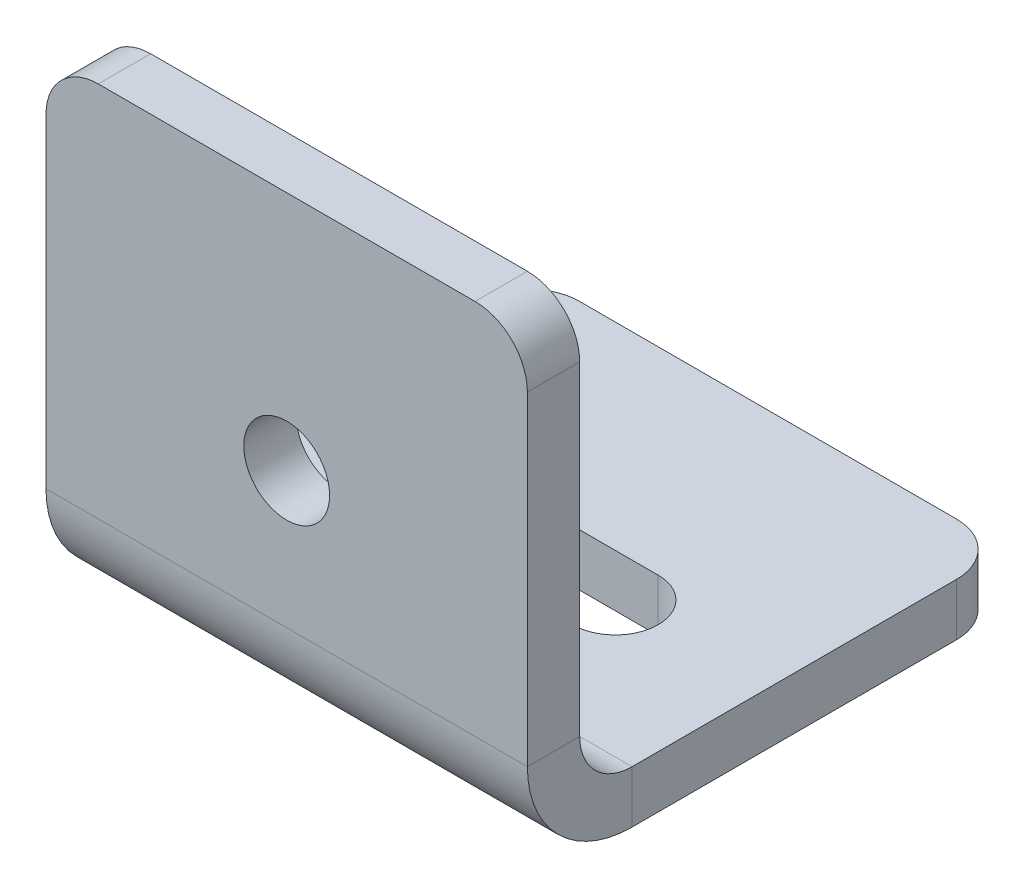
ISO-10303-21;
HEADER;
FILE_DESCRIPTION(('STEP AP214'),'2;1');
FILE_NAME('part.step','',(''),(''),'','','');
FILE_SCHEMA(('AUTOMOTIVE_DESIGN { 1 0 10303 214 1 1 1 1 }'));
ENDSEC;
DATA;
#1=APPLICATION_CONTEXT('core data for automotive mechanical design processes');
#2=APPLICATION_PROTOCOL_DEFINITION('international standard','automotive_design',2000,#1);
#3=PRODUCT_CONTEXT('',#1,'mechanical');
#4=PRODUCT('Part','Part','',(#3));
#5=PRODUCT_RELATED_PRODUCT_CATEGORY('part','',(#4));
#6=PRODUCT_DEFINITION_FORMATION('','',#4);
#7=PRODUCT_DEFINITION_CONTEXT('part definition',#1,'design');
#8=PRODUCT_DEFINITION('design','',#6,#7);
#9=PRODUCT_DEFINITION_SHAPE('','',#8);
#10=(LENGTH_UNIT() NAMED_UNIT(*) SI_UNIT(.MILLI.,.METRE.));
#11=(NAMED_UNIT(*) PLANE_ANGLE_UNIT() SI_UNIT($,.RADIAN.));
#12=(NAMED_UNIT(*) SI_UNIT($,.STERADIAN.) SOLID_ANGLE_UNIT());
#13=UNCERTAINTY_MEASURE_WITH_UNIT(LENGTH_MEASURE(1.E-05),#10,'distance_accuracy_value','');
#14=(GEOMETRIC_REPRESENTATION_CONTEXT(3) GLOBAL_UNCERTAINTY_ASSIGNED_CONTEXT((#13)) GLOBAL_UNIT_ASSIGNED_CONTEXT((#10,
#11,#12)) REPRESENTATION_CONTEXT('',''));
#15=CARTESIAN_POINT('',(0.,0.,0.));
#16=DIRECTION('',(0.,0.,1.));
#17=DIRECTION('',(1.,0.,0.));
#18=AXIS2_PLACEMENT_3D('',#15,#16,#17);
#19=CARTESIAN_POINT('',(46.,10.,0.));
#20=DIRECTION('',(1.,0.,0.));
#21=DIRECTION('',(0.,0.,-1.));
#22=AXIS2_PLACEMENT_3D('',#19,#20,#21);
#23=PLANE('',#22);
#24=DIRECTION('',(0.,0.,-1.));
#25=VECTOR('',#24,1.);
#26=CARTESIAN_POINT('',(46.,10.,0.));
#27=LINE('',#26,#25);
#28=CARTESIAN_POINT('',(46.,10.,0.));
#29=VERTEX_POINT('',#28);
#30=CARTESIAN_POINT('',(46.,10.,-5.));
#31=VERTEX_POINT('',#30);
#32=EDGE_CURVE('E243',#29,#31,#27,.T.);
#33=ORIENTED_EDGE('',*,*,#32,.F.);
#34=CARTESIAN_POINT('',(46.,10.,-10.));
#35=DIRECTION('',(-1.,0.,0.));
#36=DIRECTION('',(0.,0.,1.));
#37=AXIS2_PLACEMENT_3D('',#34,#35,#36);
#38=CIRCLE('',#37,10.);
#39=CARTESIAN_POINT('',(46.,0.,-10.));
#40=VERTEX_POINT('',#39);
#41=EDGE_CURVE('E197',#29,#40,#38,.F.);
#42=ORIENTED_EDGE('',*,*,#41,.T.);
#43=DIRECTION('',(0.,-1.,0.));
#44=VECTOR('',#43,1.);
#45=CARTESIAN_POINT('',(46.,5.,-10.));
#46=LINE('',#45,#44);
#47=CARTESIAN_POINT('',(46.,5.,-10.));
#48=VERTEX_POINT('',#47);
#49=EDGE_CURVE('E241',#48,#40,#46,.T.);
#50=ORIENTED_EDGE('',*,*,#49,.F.);
#51=CARTESIAN_POINT('',(46.,10.,-10.));
#52=DIRECTION('',(1.,0.,0.));
#53=DIRECTION('',(0.,0.,-1.));
#54=AXIS2_PLACEMENT_3D('',#51,#52,#53);
#55=CIRCLE('',#54,5.);
#56=EDGE_CURVE('E190',#31,#48,#55,.T.);
#57=ORIENTED_EDGE('',*,*,#56,.F.);
#58=EDGE_LOOP('',(#33,#42,#50,#57));
#59=FACE_BOUND('',#58,.T.);
#60=ADVANCED_FACE('F16',(#59),#23,.T.);
#61=CARTESIAN_POINT('',(46.,5.,-10.));
#62=DIRECTION('',(1.,0.,0.));
#63=DIRECTION('',(0.,0.,-1.));
#64=AXIS2_PLACEMENT_3D('',#61,#62,#63);
#65=PLANE('',#64);
#66=DIRECTION('',(0.,1.,0.));
#67=VECTOR('',#66,1.);
#68=CARTESIAN_POINT('',(46.,0.,-5.));
#69=LINE('',#68,#67);
#70=CARTESIAN_POINT('',(46.,41.,-5.));
#71=VERTEX_POINT('',#70);
#72=EDGE_CURVE('E193',#71,#31,#69,.F.);
#73=ORIENTED_EDGE('',*,*,#72,.F.);
#74=DIRECTION('',(0.,0.,-1.));
#75=VECTOR('',#74,1.);
#76=CARTESIAN_POINT('',(46.,41.,-10.));
#77=LINE('',#76,#75);
#78=CARTESIAN_POINT('',(46.,41.,0.));
#79=VERTEX_POINT('',#78);
#80=EDGE_CURVE('E256',#71,#79,#77,.F.);
#81=ORIENTED_EDGE('',*,*,#80,.T.);
#82=DIRECTION('',(0.,-1.,0.));
#83=VECTOR('',#82,1.);
#84=CARTESIAN_POINT('',(46.,0.,0.));
#85=LINE('',#84,#83);
#86=EDGE_CURVE('E195',#79,#29,#85,.T.);
#87=ORIENTED_EDGE('',*,*,#86,.T.);
#88=ORIENTED_EDGE('',*,*,#32,.T.);
#89=EDGE_LOOP('',(#73,#81,#87,#88));
#90=FACE_BOUND('',#89,.T.);
#91=ADVANCED_FACE('F321',(#90),#65,.T.);
#92=CARTESIAN_POINT('',(0.,0.,-10.));
#93=DIRECTION('',(-1.,0.,0.));
#94=DIRECTION('',(0.,0.,1.));
#95=AXIS2_PLACEMENT_3D('',#92,#93,#94);
#96=PLANE('',#95);
#97=DIRECTION('',(0.,1.,0.));
#98=VECTOR('',#97,1.);
#99=CARTESIAN_POINT('',(0.,0.,-10.));
#100=LINE('',#99,#98);
#101=CARTESIAN_POINT('',(0.,0.,-10.));
#102=VERTEX_POINT('',#101);
#103=CARTESIAN_POINT('',(0.,5.,-10.));
#104=VERTEX_POINT('',#103);
#105=EDGE_CURVE('E239',#102,#104,#100,.T.);
#106=ORIENTED_EDGE('',*,*,#105,.F.);
#107=CARTESIAN_POINT('',(0.,10.,-10.));
#108=DIRECTION('',(-1.,0.,0.));
#109=DIRECTION('',(0.,0.,1.));
#110=AXIS2_PLACEMENT_3D('',#107,#108,#109);
#111=CIRCLE('',#110,10.);
#112=CARTESIAN_POINT('',(0.,10.,0.));
#113=VERTEX_POINT('',#112);
#114=EDGE_CURVE('E188',#113,#102,#111,.F.);
#115=ORIENTED_EDGE('',*,*,#114,.F.);
#116=DIRECTION('',(0.,0.,1.));
#117=VECTOR('',#116,1.);
#118=CARTESIAN_POINT('',(0.,10.,-5.));
#119=LINE('',#118,#117);
#120=CARTESIAN_POINT('',(0.,10.,-5.));
#121=VERTEX_POINT('',#120);
#122=EDGE_CURVE('E236',#121,#113,#119,.T.);
#123=ORIENTED_EDGE('',*,*,#122,.F.);
#124=CARTESIAN_POINT('',(0.,10.,-10.));
#125=DIRECTION('',(1.,0.,0.));
#126=DIRECTION('',(0.,0.,-1.));
#127=AXIS2_PLACEMENT_3D('',#124,#125,#126);
#128=CIRCLE('',#127,5.);
#129=EDGE_CURVE('E206',#121,#104,#128,.T.);
#130=ORIENTED_EDGE('',*,*,#129,.T.);
#131=EDGE_LOOP('',(#106,#115,#123,#130));
#132=FACE_BOUND('',#131,.T.);
#133=ADVANCED_FACE('F309',(#132),#96,.T.);
#134=CARTESIAN_POINT('',(0.,10.,-5.));
#135=DIRECTION('',(-1.,0.,0.));
#136=DIRECTION('',(0.,0.,1.));
#137=AXIS2_PLACEMENT_3D('',#134,#135,#136);
#138=PLANE('',#137);
#139=DIRECTION('',(0.,0.,-1.));
#140=VECTOR('',#139,1.);
#141=CARTESIAN_POINT('',(0.,5.,0.));
#142=LINE('',#141,#140);
#143=CARTESIAN_POINT('',(0.,5.,-41.));
#144=VERTEX_POINT('',#143);
#145=EDGE_CURVE('E203',#104,#144,#142,.T.);
#146=ORIENTED_EDGE('',*,*,#145,.T.);
#147=DIRECTION('',(0.,-1.,0.));
#148=VECTOR('',#147,1.);
#149=CARTESIAN_POINT('',(0.,10.,-41.));
#150=LINE('',#149,#148);
#151=CARTESIAN_POINT('',(0.,0.,-41.));
#152=VERTEX_POINT('',#151);
#153=EDGE_CURVE('E265',#144,#152,#150,.T.);
#154=ORIENTED_EDGE('',*,*,#153,.T.);
#155=DIRECTION('',(0.,0.,-1.));
#156=VECTOR('',#155,1.);
#157=CARTESIAN_POINT('',(0.,0.,0.));
#158=LINE('',#157,#156);
#159=EDGE_CURVE('E181',#102,#152,#158,.T.);
#160=ORIENTED_EDGE('',*,*,#159,.F.);
#161=ORIENTED_EDGE('',*,*,#105,.T.);
#162=EDGE_LOOP('',(#146,#154,#160,#161));
#163=FACE_BOUND('',#162,.T.);
#164=ADVANCED_FACE('F288',(#163),#138,.T.);
#165=CARTESIAN_POINT('',(46.,0.,0.));
#166=DIRECTION('',(0.,1.,0.));
#167=DIRECTION('',(0.,0.,1.));
#168=AXIS2_PLACEMENT_3D('',#165,#166,#167);
#169=PLANE('',#168);
#170=DIRECTION('',(-1.,0.,0.));
#171=VECTOR('',#170,1.);
#172=CARTESIAN_POINT('',(14.6,0.,-27.1));
#173=LINE('',#172,#171);
#174=CARTESIAN_POINT('',(31.4,0.,-27.1));
#175=VERTEX_POINT('',#174);
#176=CARTESIAN_POINT('',(14.6,0.,-27.1));
#177=VERTEX_POINT('',#176);
#178=EDGE_CURVE('E143',#175,#177,#173,.T.);
#179=ORIENTED_EDGE('',*,*,#178,.T.);
#180=CARTESIAN_POINT('',(14.6,0.,-23.));
#181=DIRECTION('',(0.,1.,0.));
#182=DIRECTION('',(0.,0.,1.));
#183=AXIS2_PLACEMENT_3D('',#180,#181,#182);
#184=CIRCLE('',#183,4.10000000000001);
#185=CARTESIAN_POINT('',(14.6,0.,-18.9));
#186=VERTEX_POINT('',#185);
#187=EDGE_CURVE('E135',#177,#186,#184,.T.);
#188=ORIENTED_EDGE('',*,*,#187,.T.);
#189=DIRECTION('',(1.,0.,0.));
#190=VECTOR('',#189,1.);
#191=CARTESIAN_POINT('',(14.6,0.,-18.9));
#192=LINE('',#191,#190);
#193=CARTESIAN_POINT('',(31.4,0.,-18.9));
#194=VERTEX_POINT('',#193);
#195=EDGE_CURVE('E147',#186,#194,#192,.T.);
#196=ORIENTED_EDGE('',*,*,#195,.T.);
#197=CARTESIAN_POINT('',(31.4,0.,-23.));
#198=DIRECTION('',(0.,1.,0.));
#199=DIRECTION('',(0.,0.,1.));
#200=AXIS2_PLACEMENT_3D('',#197,#198,#199);
#201=CIRCLE('',#200,4.10000000000001);
#202=EDGE_CURVE('E151',#194,#175,#201,.T.);
#203=ORIENTED_EDGE('',*,*,#202,.T.);
#204=EDGE_LOOP('',(#179,#188,#196,#203));
#205=FACE_BOUND('',#204,.T.);
#206=ORIENTED_EDGE('',*,*,#159,.T.);
#207=CARTESIAN_POINT('',(5.,0.,-41.));
#208=DIRECTION('',(0.,1.,0.));
#209=DIRECTION('',(0.,0.,1.));
#210=AXIS2_PLACEMENT_3D('',#207,#208,#209);
#211=CIRCLE('',#210,5.);
#212=CARTESIAN_POINT('',(5.,0.,-46.));
#213=VERTEX_POINT('',#212);
#214=EDGE_CURVE('E270',#152,#213,#211,.F.);
#215=ORIENTED_EDGE('',*,*,#214,.T.);
#216=DIRECTION('',(-1.,0.,0.));
#217=VECTOR('',#216,1.);
#218=CARTESIAN_POINT('',(46.,0.,-46.));
#219=LINE('',#218,#217);
#220=CARTESIAN_POINT('',(41.,0.,-46.));
#221=VERTEX_POINT('',#220);
#222=EDGE_CURVE('E234',#221,#213,#219,.T.);
#223=ORIENTED_EDGE('',*,*,#222,.F.);
#224=CARTESIAN_POINT('',(41.,0.,-41.));
#225=DIRECTION('',(0.,1.,0.));
#226=DIRECTION('',(0.,0.,1.));
#227=AXIS2_PLACEMENT_3D('',#224,#225,#226);
#228=CIRCLE('',#227,5.);
#229=CARTESIAN_POINT('',(46.,0.,-41.));
#230=VERTEX_POINT('',#229);
#231=EDGE_CURVE('E268',#221,#230,#228,.F.);
#232=ORIENTED_EDGE('',*,*,#231,.T.);
#233=DIRECTION('',(0.,0.,-1.));
#234=VECTOR('',#233,1.);
#235=CARTESIAN_POINT('',(46.,0.,0.));
#236=LINE('',#235,#234);
#237=EDGE_CURVE('E185',#40,#230,#236,.T.);
#238=ORIENTED_EDGE('',*,*,#237,.F.);
#239=DIRECTION('',(-1.,0.,0.));
#240=VECTOR('',#239,1.);
#241=CARTESIAN_POINT('',(46.,0.,-10.));
#242=LINE('',#241,#240);
#243=EDGE_CURVE('E200',#40,#102,#242,.T.);
#244=ORIENTED_EDGE('',*,*,#243,.T.);
#245=EDGE_LOOP('',(#206,#215,#223,#232,#238,#244));
#246=FACE_BOUND('',#245,.T.);
#247=ADVANCED_FACE('F153',(#205,#246),#169,.F.);
#248=CARTESIAN_POINT('',(46.,5.,-46.));
#249=DIRECTION('',(0.,0.,-1.));
#250=DIRECTION('',(-1.,0.,0.));
#251=AXIS2_PLACEMENT_3D('',#248,#249,#250);
#252=PLANE('',#251);
#253=ORIENTED_EDGE('',*,*,#222,.T.);
#254=DIRECTION('',(0.,-1.,0.));
#255=VECTOR('',#254,1.);
#256=CARTESIAN_POINT('',(5.,5.,-46.));
#257=LINE('',#256,#255);
#258=CARTESIAN_POINT('',(5.,5.,-46.));
#259=VERTEX_POINT('',#258);
#260=EDGE_CURVE('E37',#213,#259,#257,.F.);
#261=ORIENTED_EDGE('',*,*,#260,.T.);
#262=DIRECTION('',(-1.,0.,0.));
#263=VECTOR('',#262,1.);
#264=CARTESIAN_POINT('',(46.,5.,-46.));
#265=LINE('',#264,#263);
#266=CARTESIAN_POINT('',(41.,5.,-46.));
#267=VERTEX_POINT('',#266);
#268=EDGE_CURVE('E232',#267,#259,#265,.T.);
#269=ORIENTED_EDGE('',*,*,#268,.F.);
#270=DIRECTION('',(0.,-1.,0.));
#271=VECTOR('',#270,1.);
#272=CARTESIAN_POINT('',(41.,5.,-46.));
#273=LINE('',#272,#271);
#274=EDGE_CURVE('E272',#267,#221,#273,.T.);
#275=ORIENTED_EDGE('',*,*,#274,.T.);
#276=EDGE_LOOP('',(#253,#261,#269,#275));
#277=FACE_BOUND('',#276,.T.);
#278=ADVANCED_FACE('F292',(#277),#252,.T.);
#279=CARTESIAN_POINT('',(46.,5.,0.));
#280=DIRECTION('',(0.,1.,0.));
#281=DIRECTION('',(0.,0.,1.));
#282=AXIS2_PLACEMENT_3D('',#279,#280,#281);
#283=PLANE('',#282);
#284=CARTESIAN_POINT('',(14.6,5.,-23.));
#285=DIRECTION('',(0.,1.,0.));
#286=DIRECTION('',(0.,0.,1.));
#287=AXIS2_PLACEMENT_3D('',#284,#285,#286);
#288=CIRCLE('',#287,4.10000000000001);
#289=CARTESIAN_POINT('',(14.6,5.,-27.1));
#290=VERTEX_POINT('',#289);
#291=CARTESIAN_POINT('',(14.6,5.,-18.9));
#292=VERTEX_POINT('',#291);
#293=EDGE_CURVE('E138',#290,#292,#288,.T.);
#294=ORIENTED_EDGE('',*,*,#293,.F.);
#295=DIRECTION('',(-1.,0.,0.));
#296=VECTOR('',#295,1.);
#297=CARTESIAN_POINT('',(14.6,5.,-27.1));
#298=LINE('',#297,#296);
#299=CARTESIAN_POINT('',(31.4,5.,-27.1));
#300=VERTEX_POINT('',#299);
#301=EDGE_CURVE('E156',#300,#290,#298,.T.);
#302=ORIENTED_EDGE('',*,*,#301,.F.);
#303=CARTESIAN_POINT('',(31.4,5.,-23.));
#304=DIRECTION('',(0.,1.,0.));
#305=DIRECTION('',(0.,0.,1.));
#306=AXIS2_PLACEMENT_3D('',#303,#304,#305);
#307=CIRCLE('',#306,4.10000000000001);
#308=CARTESIAN_POINT('',(31.4,5.,-18.9));
#309=VERTEX_POINT('',#308);
#310=EDGE_CURVE('E160',#309,#300,#307,.T.);
#311=ORIENTED_EDGE('',*,*,#310,.F.);
#312=DIRECTION('',(1.,0.,0.));
#313=VECTOR('',#312,1.);
#314=CARTESIAN_POINT('',(14.6,5.,-18.9));
#315=LINE('',#314,#313);
#316=EDGE_CURVE('E167',#292,#309,#315,.T.);
#317=ORIENTED_EDGE('',*,*,#316,.F.);
#318=EDGE_LOOP('',(#294,#302,#311,#317));
#319=FACE_BOUND('',#318,.T.);
#320=ORIENTED_EDGE('',*,*,#268,.T.);
#321=CARTESIAN_POINT('',(5.,5.,-41.));
#322=DIRECTION('',(0.,1.,0.));
#323=DIRECTION('',(0.,0.,1.));
#324=AXIS2_PLACEMENT_3D('',#321,#322,#323);
#325=CIRCLE('',#324,5.);
#326=EDGE_CURVE('E24',#259,#144,#325,.T.);
#327=ORIENTED_EDGE('',*,*,#326,.T.);
#328=ORIENTED_EDGE('',*,*,#145,.F.);
#329=DIRECTION('',(-1.,0.,0.));
#330=VECTOR('',#329,1.);
#331=CARTESIAN_POINT('',(46.,5.,-10.));
#332=LINE('',#331,#330);
#333=EDGE_CURVE('E229',#48,#104,#332,.T.);
#334=ORIENTED_EDGE('',*,*,#333,.F.);
#335=DIRECTION('',(0.,0.,-1.));
#336=VECTOR('',#335,1.);
#337=CARTESIAN_POINT('',(46.,5.,0.));
#338=LINE('',#337,#336);
#339=CARTESIAN_POINT('',(46.,5.,-41.));
#340=VERTEX_POINT('',#339);
#341=EDGE_CURVE('E187',#48,#340,#338,.T.);
#342=ORIENTED_EDGE('',*,*,#341,.T.);
#343=CARTESIAN_POINT('',(41.,5.,-41.));
#344=DIRECTION('',(0.,1.,0.));
#345=DIRECTION('',(0.,0.,1.));
#346=AXIS2_PLACEMENT_3D('',#343,#344,#345);
#347=CIRCLE('',#346,5.);
#348=EDGE_CURVE('E276',#340,#267,#347,.T.);
#349=ORIENTED_EDGE('',*,*,#348,.T.);
#350=EDGE_LOOP('',(#320,#327,#328,#334,#342,#349));
#351=FACE_BOUND('',#350,.T.);
#352=ADVANCED_FACE('F283',(#319,#351),#283,.T.);
#353=CARTESIAN_POINT('',(46.,10.,-10.));
#354=DIRECTION('',(-1.,0.,0.));
#355=DIRECTION('',(0.,0.,1.));
#356=AXIS2_PLACEMENT_3D('',#353,#354,#355);
#357=CYLINDRICAL_SURFACE('',#356,5.);
#358=ORIENTED_EDGE('',*,*,#129,.F.);
#359=DIRECTION('',(-1.,0.,0.));
#360=VECTOR('',#359,1.);
#361=CARTESIAN_POINT('',(46.,10.,-5.));
#362=LINE('',#361,#360);
#363=EDGE_CURVE('E226',#31,#121,#362,.T.);
#364=ORIENTED_EDGE('',*,*,#363,.F.);
#365=ORIENTED_EDGE('',*,*,#56,.T.);
#366=ORIENTED_EDGE('',*,*,#333,.T.);
#367=EDGE_LOOP('',(#358,#364,#365,#366));
#368=FACE_BOUND('',#367,.T.);
#369=ADVANCED_FACE('F313',(#368),#357,.F.);
#370=CARTESIAN_POINT('',(46.,0.,-5.));
#371=DIRECTION('',(0.,0.,-1.));
#372=DIRECTION('',(-1.,0.,0.));
#373=AXIS2_PLACEMENT_3D('',#370,#371,#372);
#374=PLANE('',#373);
#375=CARTESIAN_POINT('',(23.,23.,-5.));
#376=DIRECTION('',(0.,0.,-1.));
#377=DIRECTION('',(-1.,0.,0.));
#378=AXIS2_PLACEMENT_3D('',#375,#376,#377);
#379=CIRCLE('',#378,4.1);
#380=CARTESIAN_POINT('',(18.9,23.,-5.));
#381=VERTEX_POINT('',#380);
#382=EDGE_CURVE('E174',#381,#381,#379,.T.);
#383=ORIENTED_EDGE('',*,*,#382,.F.);
#384=EDGE_LOOP('',(#383));
#385=FACE_BOUND('',#384,.T.);
#386=DIRECTION('',(-1.,0.,0.));
#387=VECTOR('',#386,1.);
#388=CARTESIAN_POINT('',(46.,46.,-5.));
#389=LINE('',#388,#387);
#390=CARTESIAN_POINT('',(41.,46.,-5.));
#391=VERTEX_POINT('',#390);
#392=CARTESIAN_POINT('',(5.,46.,-5.));
#393=VERTEX_POINT('',#392);
#394=EDGE_CURVE('E223',#391,#393,#389,.T.);
#395=ORIENTED_EDGE('',*,*,#394,.F.);
#396=CARTESIAN_POINT('',(41.,41.,-5.));
#397=DIRECTION('',(0.,0.,-1.));
#398=DIRECTION('',(-1.,0.,0.));
#399=AXIS2_PLACEMENT_3D('',#396,#397,#398);
#400=CIRCLE('',#399,5.);
#401=EDGE_CURVE('E254',#391,#71,#400,.T.);
#402=ORIENTED_EDGE('',*,*,#401,.T.);
#403=ORIENTED_EDGE('',*,*,#72,.T.);
#404=ORIENTED_EDGE('',*,*,#363,.T.);
#405=DIRECTION('',(0.,1.,0.));
#406=VECTOR('',#405,1.);
#407=CARTESIAN_POINT('',(0.,0.,-5.));
#408=LINE('',#407,#406);
#409=CARTESIAN_POINT('',(0.,41.,-5.));
#410=VERTEX_POINT('',#409);
#411=EDGE_CURVE('E209',#410,#121,#408,.F.);
#412=ORIENTED_EDGE('',*,*,#411,.F.);
#413=CARTESIAN_POINT('',(5.,41.,-5.));
#414=DIRECTION('',(0.,0.,-1.));
#415=DIRECTION('',(-1.,0.,0.));
#416=AXIS2_PLACEMENT_3D('',#413,#414,#415);
#417=CIRCLE('',#416,5.);
#418=EDGE_CURVE('E252',#410,#393,#417,.T.);
#419=ORIENTED_EDGE('',*,*,#418,.T.);
#420=EDGE_LOOP('',(#395,#402,#403,#404,#412,#419));
#421=FACE_BOUND('',#420,.T.);
#422=ADVANCED_FACE('F317',(#385,#421),#374,.T.);
#423=CARTESIAN_POINT('',(46.,46.,0.));
#424=DIRECTION('',(0.,1.,0.));
#425=DIRECTION('',(0.,0.,1.));
#426=AXIS2_PLACEMENT_3D('',#423,#424,#425);
#427=PLANE('',#426);
#428=DIRECTION('',(-1.,0.,0.));
#429=VECTOR('',#428,1.);
#430=CARTESIAN_POINT('',(46.,46.,0.));
#431=LINE('',#430,#429);
#432=CARTESIAN_POINT('',(41.,46.,0.));
#433=VERTEX_POINT('',#432);
#434=CARTESIAN_POINT('',(5.,46.,0.));
#435=VERTEX_POINT('',#434);
#436=EDGE_CURVE('E220',#433,#435,#431,.T.);
#437=ORIENTED_EDGE('',*,*,#436,.F.);
#438=DIRECTION('',(0.,0.,-1.));
#439=VECTOR('',#438,1.);
#440=CARTESIAN_POINT('',(41.,46.,0.));
#441=LINE('',#440,#439);
#442=EDGE_CURVE('E249',#433,#391,#441,.T.);
#443=ORIENTED_EDGE('',*,*,#442,.T.);
#444=ORIENTED_EDGE('',*,*,#394,.T.);
#445=DIRECTION('',(0.,0.,-1.));
#446=VECTOR('',#445,1.);
#447=CARTESIAN_POINT('',(5.,46.,0.));
#448=LINE('',#447,#446);
#449=EDGE_CURVE('E246',#393,#435,#448,.F.);
#450=ORIENTED_EDGE('',*,*,#449,.T.);
#451=EDGE_LOOP('',(#437,#443,#444,#450));
#452=FACE_BOUND('',#451,.T.);
#453=ADVANCED_FACE('F331',(#452),#427,.T.);
#454=CARTESIAN_POINT('',(46.,0.,0.));
#455=DIRECTION('',(0.,0.,-1.));
#456=DIRECTION('',(-1.,0.,0.));
#457=AXIS2_PLACEMENT_3D('',#454,#455,#456);
#458=PLANE('',#457);
#459=CARTESIAN_POINT('',(23.,23.,0.));
#460=DIRECTION('',(0.,0.,-1.));
#461=DIRECTION('',(-1.,0.,0.));
#462=AXIS2_PLACEMENT_3D('',#459,#460,#461);
#463=CIRCLE('',#462,4.1);
#464=CARTESIAN_POINT('',(18.9,23.,0.));
#465=VERTEX_POINT('',#464);
#466=EDGE_CURVE('E178',#465,#465,#463,.T.);
#467=ORIENTED_EDGE('',*,*,#466,.T.);
#468=EDGE_LOOP('',(#467));
#469=FACE_BOUND('',#468,.T.);
#470=ORIENTED_EDGE('',*,*,#86,.F.);
#471=CARTESIAN_POINT('',(41.,41.,0.));
#472=DIRECTION('',(0.,0.,-1.));
#473=DIRECTION('',(-1.,0.,0.));
#474=AXIS2_PLACEMENT_3D('',#471,#472,#473);
#475=CIRCLE('',#474,5.);
#476=EDGE_CURVE('E260',#79,#433,#475,.F.);
#477=ORIENTED_EDGE('',*,*,#476,.T.);
#478=ORIENTED_EDGE('',*,*,#436,.T.);
#479=CARTESIAN_POINT('',(5.,41.,0.));
#480=DIRECTION('',(0.,0.,-1.));
#481=DIRECTION('',(-1.,0.,0.));
#482=AXIS2_PLACEMENT_3D('',#479,#480,#481);
#483=CIRCLE('',#482,5.);
#484=CARTESIAN_POINT('',(0.,41.,0.));
#485=VERTEX_POINT('',#484);
#486=EDGE_CURVE('E258',#435,#485,#483,.F.);
#487=ORIENTED_EDGE('',*,*,#486,.T.);
#488=DIRECTION('',(0.,-1.,0.));
#489=VECTOR('',#488,1.);
#490=CARTESIAN_POINT('',(0.,0.,0.));
#491=LINE('',#490,#489);
#492=EDGE_CURVE('E211',#485,#113,#491,.T.);
#493=ORIENTED_EDGE('',*,*,#492,.T.);
#494=DIRECTION('',(-1.,0.,0.));
#495=VECTOR('',#494,1.);
#496=CARTESIAN_POINT('',(46.,10.,0.));
#497=LINE('',#496,#495);
#498=EDGE_CURVE('E217',#29,#113,#497,.T.);
#499=ORIENTED_EDGE('',*,*,#498,.F.);
#500=EDGE_LOOP('',(#470,#477,#478,#487,#493,#499));
#501=FACE_BOUND('',#500,.T.);
#502=ADVANCED_FACE('F325',(#469,#501),#458,.F.);
#503=CARTESIAN_POINT('',(46.,10.,-10.));
#504=DIRECTION('',(-1.,0.,0.));
#505=DIRECTION('',(0.,0.,1.));
#506=AXIS2_PLACEMENT_3D('',#503,#504,#505);
#507=CYLINDRICAL_SURFACE('',#506,10.);
#508=ORIENTED_EDGE('',*,*,#114,.T.);
#509=ORIENTED_EDGE('',*,*,#243,.F.);
#510=ORIENTED_EDGE('',*,*,#41,.F.);
#511=ORIENTED_EDGE('',*,*,#498,.T.);
#512=EDGE_LOOP('',(#508,#509,#510,#511));
#513=FACE_BOUND('',#512,.T.);
#514=ADVANCED_FACE('F305',(#513),#507,.T.);
#515=CARTESIAN_POINT('',(46.,10.,-10.));
#516=DIRECTION('',(1.,0.,0.));
#517=DIRECTION('',(0.,0.,-1.));
#518=AXIS2_PLACEMENT_3D('',#515,#516,#517);
#519=PLANE('',#518);
#520=ORIENTED_EDGE('',*,*,#237,.T.);
#521=DIRECTION('',(0.,-1.,0.));
#522=VECTOR('',#521,1.);
#523=CARTESIAN_POINT('',(46.,10.,-41.));
#524=LINE('',#523,#522);
#525=EDGE_CURVE('E10',#230,#340,#524,.F.);
#526=ORIENTED_EDGE('',*,*,#525,.T.);
#527=ORIENTED_EDGE('',*,*,#341,.F.);
#528=ORIENTED_EDGE('',*,*,#49,.T.);
#529=EDGE_LOOP('',(#520,#526,#527,#528));
#530=FACE_BOUND('',#529,.T.);
#531=ADVANCED_FACE('F297',(#530),#519,.T.);
#532=CARTESIAN_POINT('',(0.,10.,-10.));
#533=DIRECTION('',(1.,0.,0.));
#534=DIRECTION('',(0.,0.,-1.));
#535=AXIS2_PLACEMENT_3D('',#532,#533,#534);
#536=PLANE('',#535);
#537=ORIENTED_EDGE('',*,*,#492,.F.);
#538=DIRECTION('',(0.,0.,-1.));
#539=VECTOR('',#538,1.);
#540=CARTESIAN_POINT('',(0.,41.,-5.));
#541=LINE('',#540,#539);
#542=EDGE_CURVE('E262',#485,#410,#541,.T.);
#543=ORIENTED_EDGE('',*,*,#542,.T.);
#544=ORIENTED_EDGE('',*,*,#411,.T.);
#545=ORIENTED_EDGE('',*,*,#122,.T.);
#546=EDGE_LOOP('',(#537,#543,#544,#545));
#547=FACE_BOUND('',#546,.T.);
#548=ADVANCED_FACE('F339',(#547),#536,.F.);
#549=CARTESIAN_POINT('',(23.,23.,0.));
#550=DIRECTION('',(0.,0.,-1.));
#551=DIRECTION('',(-1.,0.,0.));
#552=AXIS2_PLACEMENT_3D('',#549,#550,#551);
#553=CYLINDRICAL_SURFACE('',#552,4.1);
#554=ORIENTED_EDGE('',*,*,#466,.F.);
#555=EDGE_LOOP('',(#554));
#556=FACE_BOUND('',#555,.T.);
#557=ORIENTED_EDGE('',*,*,#382,.T.);
#558=EDGE_LOOP('',(#557));
#559=FACE_BOUND('',#558,.T.);
#560=ADVANCED_FACE('F341',(#556,#559),#553,.F.);
#561=CARTESIAN_POINT('',(14.6,0.,-23.));
#562=DIRECTION('',(0.,1.,0.));
#563=DIRECTION('',(0.,0.,1.));
#564=AXIS2_PLACEMENT_3D('',#561,#562,#563);
#565=CYLINDRICAL_SURFACE('',#564,4.10000000000001);
#566=ORIENTED_EDGE('',*,*,#293,.T.);
#567=DIRECTION('',(0.,1.,0.));
#568=VECTOR('',#567,1.);
#569=CARTESIAN_POINT('',(14.6,0.,-18.9));
#570=LINE('',#569,#568);
#571=EDGE_CURVE('E131',#186,#292,#570,.T.);
#572=ORIENTED_EDGE('',*,*,#571,.F.);
#573=ORIENTED_EDGE('',*,*,#187,.F.);
#574=DIRECTION('',(0.,1.,0.));
#575=VECTOR('',#574,1.);
#576=CARTESIAN_POINT('',(14.6,0.,-27.1));
#577=LINE('',#576,#575);
#578=EDGE_CURVE('E172',#177,#290,#577,.T.);
#579=ORIENTED_EDGE('',*,*,#578,.T.);
#580=EDGE_LOOP('',(#566,#572,#573,#579));
#581=FACE_BOUND('',#580,.T.);
#582=ADVANCED_FACE('F133',(#581),#565,.F.);
#583=CARTESIAN_POINT('',(14.6,0.,-27.1));
#584=DIRECTION('',(0.,0.,-1.));
#585=DIRECTION('',(-1.,0.,0.));
#586=AXIS2_PLACEMENT_3D('',#583,#584,#585);
#587=PLANE('',#586);
#588=ORIENTED_EDGE('',*,*,#301,.T.);
#589=ORIENTED_EDGE('',*,*,#578,.F.);
#590=ORIENTED_EDGE('',*,*,#178,.F.);
#591=DIRECTION('',(0.,1.,0.));
#592=VECTOR('',#591,1.);
#593=CARTESIAN_POINT('',(31.4,0.,-27.1));
#594=LINE('',#593,#592);
#595=EDGE_CURVE('E175',#175,#300,#594,.T.);
#596=ORIENTED_EDGE('',*,*,#595,.T.);
#597=EDGE_LOOP('',(#588,#589,#590,#596));
#598=FACE_BOUND('',#597,.T.);
#599=ADVANCED_FACE('F415',(#598),#587,.F.);
#600=CARTESIAN_POINT('',(31.4,0.,-23.));
#601=DIRECTION('',(0.,1.,0.));
#602=DIRECTION('',(0.,0.,1.));
#603=AXIS2_PLACEMENT_3D('',#600,#601,#602);
#604=CYLINDRICAL_SURFACE('',#603,4.10000000000001);
#605=ORIENTED_EDGE('',*,*,#310,.T.);
#606=ORIENTED_EDGE('',*,*,#595,.F.);
#607=ORIENTED_EDGE('',*,*,#202,.F.);
#608=DIRECTION('',(0.,1.,0.));
#609=VECTOR('',#608,1.);
#610=CARTESIAN_POINT('',(31.4,0.,-18.9));
#611=LINE('',#610,#609);
#612=EDGE_CURVE('E142',#194,#309,#611,.T.);
#613=ORIENTED_EDGE('',*,*,#612,.T.);
#614=EDGE_LOOP('',(#605,#606,#607,#613));
#615=FACE_BOUND('',#614,.T.);
#616=ADVANCED_FACE('F405',(#615),#604,.F.);
#617=CARTESIAN_POINT('',(14.6,0.,-18.9));
#618=DIRECTION('',(0.,0.,1.));
#619=DIRECTION('',(1.,0.,0.));
#620=AXIS2_PLACEMENT_3D('',#617,#618,#619);
#621=PLANE('',#620);
#622=ORIENTED_EDGE('',*,*,#316,.T.);
#623=ORIENTED_EDGE('',*,*,#612,.F.);
#624=ORIENTED_EDGE('',*,*,#195,.F.);
#625=ORIENTED_EDGE('',*,*,#571,.T.);
#626=EDGE_LOOP('',(#622,#623,#624,#625));
#627=FACE_BOUND('',#626,.T.);
#628=ADVANCED_FACE('F148',(#627),#621,.F.);
#629=CARTESIAN_POINT('',(41.,41.,0.));
#630=DIRECTION('',(0.,0.,-1.));
#631=DIRECTION('',(-1.,0.,0.));
#632=AXIS2_PLACEMENT_3D('',#629,#630,#631);
#633=CYLINDRICAL_SURFACE('',#632,5.);
#634=ORIENTED_EDGE('',*,*,#476,.F.);
#635=ORIENTED_EDGE('',*,*,#80,.F.);
#636=ORIENTED_EDGE('',*,*,#401,.F.);
#637=ORIENTED_EDGE('',*,*,#442,.F.);
#638=EDGE_LOOP('',(#634,#635,#636,#637));
#639=FACE_BOUND('',#638,.T.);
#640=ADVANCED_FACE('F329',(#639),#633,.T.);
#641=CARTESIAN_POINT('',(5.,41.,-10.));
#642=DIRECTION('',(0.,0.,1.));
#643=DIRECTION('',(1.,0.,0.));
#644=AXIS2_PLACEMENT_3D('',#641,#642,#643);
#645=CYLINDRICAL_SURFACE('',#644,5.);
#646=ORIENTED_EDGE('',*,*,#486,.F.);
#647=ORIENTED_EDGE('',*,*,#449,.F.);
#648=ORIENTED_EDGE('',*,*,#418,.F.);
#649=ORIENTED_EDGE('',*,*,#542,.F.);
#650=EDGE_LOOP('',(#646,#647,#648,#649));
#651=FACE_BOUND('',#650,.T.);
#652=ADVANCED_FACE('F336',(#651),#645,.T.);
#653=CARTESIAN_POINT('',(5.,10.,-41.));
#654=DIRECTION('',(0.,-1.,0.));
#655=DIRECTION('',(0.,0.,-1.));
#656=AXIS2_PLACEMENT_3D('',#653,#654,#655);
#657=CYLINDRICAL_SURFACE('',#656,5.);
#658=ORIENTED_EDGE('',*,*,#326,.F.);
#659=ORIENTED_EDGE('',*,*,#260,.F.);
#660=ORIENTED_EDGE('',*,*,#214,.F.);
#661=ORIENTED_EDGE('',*,*,#153,.F.);
#662=EDGE_LOOP('',(#658,#659,#660,#661));
#663=FACE_BOUND('',#662,.T.);
#664=ADVANCED_FACE('F290',(#663),#657,.T.);
#665=CARTESIAN_POINT('',(41.,5.,-41.));
#666=DIRECTION('',(0.,-1.,0.));
#667=DIRECTION('',(0.,0.,-1.));
#668=AXIS2_PLACEMENT_3D('',#665,#666,#667);
#669=CYLINDRICAL_SURFACE('',#668,5.);
#670=ORIENTED_EDGE('',*,*,#348,.F.);
#671=ORIENTED_EDGE('',*,*,#525,.F.);
#672=ORIENTED_EDGE('',*,*,#231,.F.);
#673=ORIENTED_EDGE('',*,*,#274,.F.);
#674=EDGE_LOOP('',(#670,#671,#672,#673));
#675=FACE_BOUND('',#674,.T.);
#676=ADVANCED_FACE('F18',(#675),#669,.T.);
#677=CLOSED_SHELL('',(#60,#91,#133,#164,#247,#278,#352,#369,#422,#453,#502,#514,#531,#548,#560,
#582,#599,#616,#628,#640,#652,#664,#676));
#678=MANIFOLD_SOLID_BREP('B1',#677);
#679=ADVANCED_BREP_SHAPE_REPRESENTATION('',(#18,#678),#14);
#680=SHAPE_DEFINITION_REPRESENTATION(#9,#679);
ENDSEC;
END-ISO-10303-21;
